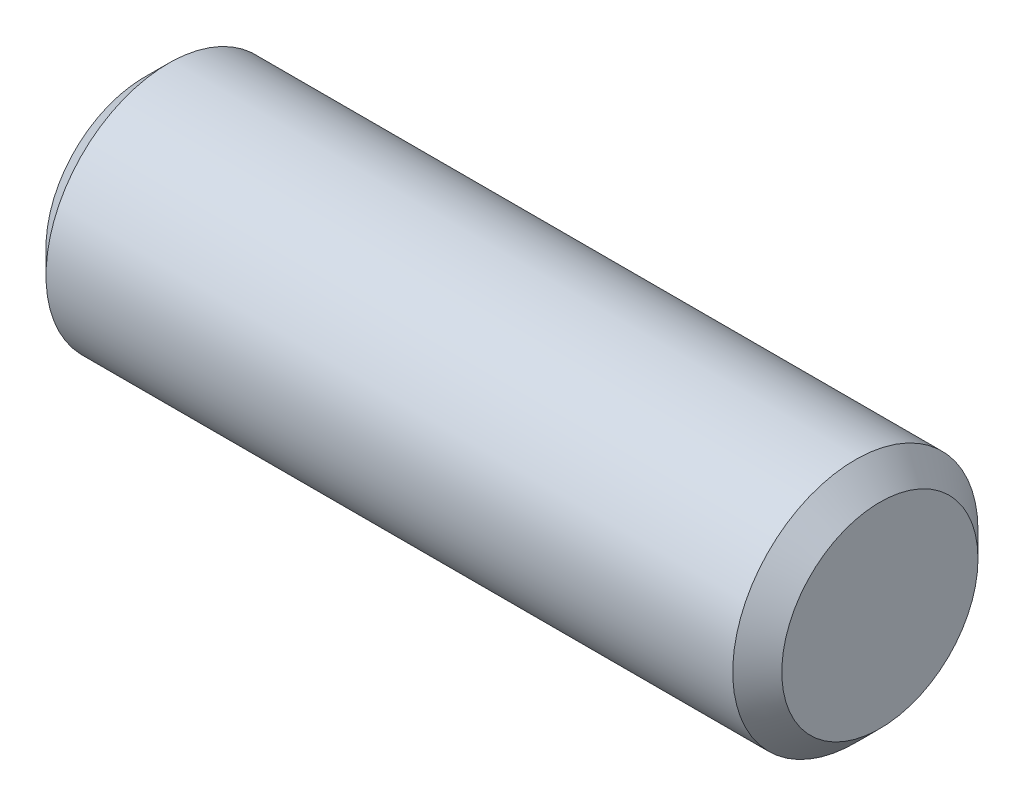
ISO-10303-21;
HEADER;
FILE_DESCRIPTION(('STEP AP214'),'2;1');
FILE_NAME('part.step','',(''),(''),'','','');
FILE_SCHEMA(('AUTOMOTIVE_DESIGN { 1 0 10303 214 1 1 1 1 }'));
ENDSEC;
DATA;
#1=APPLICATION_CONTEXT('core data for automotive mechanical design processes');
#2=APPLICATION_PROTOCOL_DEFINITION('international standard','automotive_design',2000,#1);
#3=PRODUCT_CONTEXT('',#1,'mechanical');
#4=PRODUCT('Part','Part','',(#3));
#5=PRODUCT_RELATED_PRODUCT_CATEGORY('part','',(#4));
#6=PRODUCT_DEFINITION_FORMATION('','',#4);
#7=PRODUCT_DEFINITION_CONTEXT('part definition',#1,'design');
#8=PRODUCT_DEFINITION('design','',#6,#7);
#9=PRODUCT_DEFINITION_SHAPE('','',#8);
#10=(LENGTH_UNIT() NAMED_UNIT(*) SI_UNIT(.MILLI.,.METRE.));
#11=(NAMED_UNIT(*) PLANE_ANGLE_UNIT() SI_UNIT($,.RADIAN.));
#12=(NAMED_UNIT(*) SI_UNIT($,.STERADIAN.) SOLID_ANGLE_UNIT());
#13=UNCERTAINTY_MEASURE_WITH_UNIT(LENGTH_MEASURE(1.E-05),#10,'distance_accuracy_value','');
#14=(GEOMETRIC_REPRESENTATION_CONTEXT(3) GLOBAL_UNCERTAINTY_ASSIGNED_CONTEXT((#13)) GLOBAL_UNIT_ASSIGNED_CONTEXT((#10,
#11,#12)) REPRESENTATION_CONTEXT('',''));
#15=CARTESIAN_POINT('',(0.,0.,0.));
#16=DIRECTION('',(0.,0.,1.));
#17=DIRECTION('',(1.,0.,0.));
#18=AXIS2_PLACEMENT_3D('',#15,#16,#17);
#19=CARTESIAN_POINT('',(-4.7625,0.,0.));
#20=DIRECTION('',(1.,0.,0.));
#21=DIRECTION('',(0.,0.,-1.));
#22=AXIS2_PLACEMENT_3D('',#19,#20,#21);
#23=CYLINDRICAL_SURFACE('',#22,1.5875);
#24=CARTESIAN_POINT('',(4.445,0.,0.));
#25=DIRECTION('',(1.,0.,0.));
#26=DIRECTION('',(0.,0.,-1.));
#27=AXIS2_PLACEMENT_3D('',#24,#25,#26);
#28=CIRCLE('',#27,1.5875);
#29=CARTESIAN_POINT('',(4.445,0.,-1.5875));
#30=VERTEX_POINT('',#29);
#31=EDGE_CURVE('E40',#30,#30,#28,.F.);
#32=ORIENTED_EDGE('',*,*,#31,.T.);
#33=EDGE_LOOP('',(#32));
#34=FACE_BOUND('',#33,.T.);
#35=CARTESIAN_POINT('',(-4.445,0.,0.));
#36=DIRECTION('',(1.,0.,0.));
#37=DIRECTION('',(0.,0.,-1.));
#38=AXIS2_PLACEMENT_3D('',#35,#36,#37);
#39=CIRCLE('',#38,1.5875);
#40=CARTESIAN_POINT('',(-4.445,0.,-1.5875));
#41=VERTEX_POINT('',#40);
#42=EDGE_CURVE('E44',#41,#41,#39,.T.);
#43=ORIENTED_EDGE('',*,*,#42,.T.);
#44=EDGE_LOOP('',(#43));
#45=FACE_BOUND('',#44,.T.);
#46=ADVANCED_FACE('F33',(#34,#45),#23,.T.);
#47=CARTESIAN_POINT('',(-4.7625,0.,0.));
#48=DIRECTION('',(1.,0.,0.));
#49=DIRECTION('',(0.,0.,-1.));
#50=AXIS2_PLACEMENT_3D('',#47,#48,#49);
#51=PLANE('',#50);
#52=CARTESIAN_POINT('',(-4.7625,0.,0.));
#53=DIRECTION('',(1.,0.,0.));
#54=DIRECTION('',(0.,0.,-1.));
#55=AXIS2_PLACEMENT_3D('',#52,#53,#54);
#56=CIRCLE('',#55,1.27);
#57=CARTESIAN_POINT('',(-4.7625,0.,-1.27));
#58=VERTEX_POINT('',#57);
#59=EDGE_CURVE('E10',#58,#58,#56,.F.);
#60=ORIENTED_EDGE('',*,*,#59,.T.);
#61=EDGE_LOOP('',(#60));
#62=FACE_BOUND('',#61,.T.);
#63=ADVANCED_FACE('F64',(#62),#51,.F.);
#64=CARTESIAN_POINT('',(4.7625,0.,0.));
#65=DIRECTION('',(1.,0.,0.));
#66=DIRECTION('',(0.,0.,-1.));
#67=AXIS2_PLACEMENT_3D('',#64,#65,#66);
#68=PLANE('',#67);
#69=CARTESIAN_POINT('',(4.7625,0.,0.));
#70=DIRECTION('',(1.,0.,0.));
#71=DIRECTION('',(0.,0.,-1.));
#72=AXIS2_PLACEMENT_3D('',#69,#70,#71);
#73=CIRCLE('',#72,1.27);
#74=CARTESIAN_POINT('',(4.7625,0.,-1.27));
#75=VERTEX_POINT('',#74);
#76=EDGE_CURVE('E48',#75,#75,#73,.T.);
#77=ORIENTED_EDGE('',*,*,#76,.T.);
#78=EDGE_LOOP('',(#77));
#79=FACE_BOUND('',#78,.T.);
#80=ADVANCED_FACE('F54',(#79),#68,.T.);
#81=CARTESIAN_POINT('',(4.7625,0.,0.));
#82=DIRECTION('',(-1.,0.,0.));
#83=DIRECTION('',(0.,0.,1.));
#84=AXIS2_PLACEMENT_3D('',#81,#82,#83);
#85=CONICAL_SURFACE('',#84,1.27,0.785398163397446);
#86=ORIENTED_EDGE('',*,*,#31,.F.);
#87=EDGE_LOOP('',(#86));
#88=FACE_BOUND('',#87,.T.);
#89=ORIENTED_EDGE('',*,*,#76,.F.);
#90=EDGE_LOOP('',(#89));
#91=FACE_BOUND('',#90,.T.);
#92=ADVANCED_FACE('F56',(#88,#91),#85,.T.);
#93=CARTESIAN_POINT('',(-4.445,0.,0.));
#94=DIRECTION('',(1.,0.,0.));
#95=DIRECTION('',(0.,0.,-1.));
#96=AXIS2_PLACEMENT_3D('',#93,#94,#95);
#97=CONICAL_SURFACE('',#96,1.5875,0.78539816339745);
#98=ORIENTED_EDGE('',*,*,#59,.F.);
#99=EDGE_LOOP('',(#98));
#100=FACE_BOUND('',#99,.T.);
#101=ORIENTED_EDGE('',*,*,#42,.F.);
#102=EDGE_LOOP('',(#101));
#103=FACE_BOUND('',#102,.T.);
#104=ADVANCED_FACE('F35',(#100,#103),#97,.T.);
#105=CLOSED_SHELL('',(#46,#63,#80,#92,#104));
#106=MANIFOLD_SOLID_BREP('B2',#105);
#107=ADVANCED_BREP_SHAPE_REPRESENTATION('',(#18,#106),#14);
#108=SHAPE_DEFINITION_REPRESENTATION(#9,#107);
ENDSEC;
END-ISO-10303-21;
